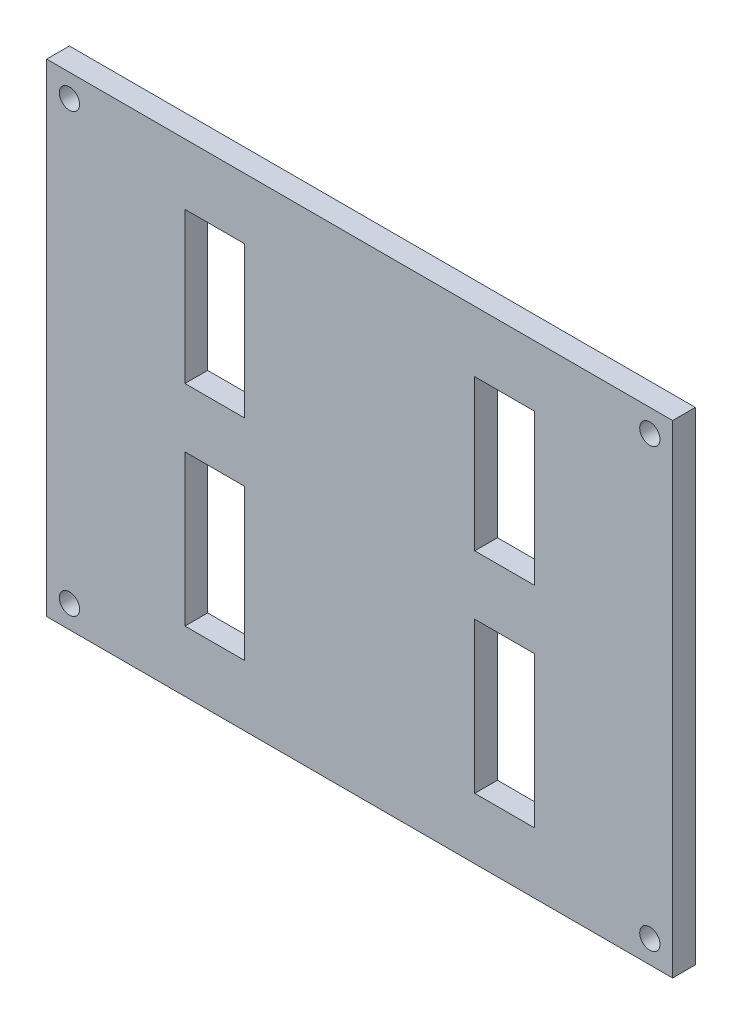
ISO-10303-21;
HEADER;
FILE_DESCRIPTION(('STEP AP214'),'2;1');
FILE_NAME('part.step','',(''),(''),'','','');
FILE_SCHEMA(('AUTOMOTIVE_DESIGN { 1 0 10303 214 1 1 1 1 }'));
ENDSEC;
DATA;
#1=APPLICATION_CONTEXT('core data for automotive mechanical design processes');
#2=APPLICATION_PROTOCOL_DEFINITION('international standard','automotive_design',2000,#1);
#3=PRODUCT_CONTEXT('',#1,'mechanical');
#4=PRODUCT('Part','Part','',(#3));
#5=PRODUCT_RELATED_PRODUCT_CATEGORY('part','',(#4));
#6=PRODUCT_DEFINITION_FORMATION('','',#4);
#7=PRODUCT_DEFINITION_CONTEXT('part definition',#1,'design');
#8=PRODUCT_DEFINITION('design','',#6,#7);
#9=PRODUCT_DEFINITION_SHAPE('','',#8);
#10=(LENGTH_UNIT() NAMED_UNIT(*) SI_UNIT(.MILLI.,.METRE.));
#11=(NAMED_UNIT(*) PLANE_ANGLE_UNIT() SI_UNIT($,.RADIAN.));
#12=(NAMED_UNIT(*) SI_UNIT($,.STERADIAN.) SOLID_ANGLE_UNIT());
#13=UNCERTAINTY_MEASURE_WITH_UNIT(LENGTH_MEASURE(1.E-05),#10,'distance_accuracy_value','');
#14=(GEOMETRIC_REPRESENTATION_CONTEXT(3) GLOBAL_UNCERTAINTY_ASSIGNED_CONTEXT((#13)) GLOBAL_UNIT_ASSIGNED_CONTEXT((#10,
#11,#12)) REPRESENTATION_CONTEXT('',''));
#15=CARTESIAN_POINT('',(0.,0.,0.));
#16=DIRECTION('',(0.,0.,1.));
#17=DIRECTION('',(1.,0.,0.));
#18=AXIS2_PLACEMENT_3D('',#15,#16,#17);
#19=CARTESIAN_POINT('',(0.,0.,0.));
#20=DIRECTION('',(0.,0.,1.));
#21=DIRECTION('',(1.,0.,0.));
#22=AXIS2_PLACEMENT_3D('',#19,#20,#21);
#23=PLANE('',#22);
#24=DIRECTION('',(1.,0.,0.));
#25=VECTOR('',#24,1.);
#26=CARTESIAN_POINT('',(0.,25.215,0.));
#27=LINE('',#26,#25);
#28=CARTESIAN_POINT('',(16.085,25.215,0.));
#29=VERTEX_POINT('',#28);
#30=CARTESIAN_POINT('',(24.415,25.215,0.));
#31=VERTEX_POINT('',#30);
#32=EDGE_CURVE('E289',#29,#31,#27,.T.);
#33=ORIENTED_EDGE('',*,*,#32,.F.);
#34=DIRECTION('',(0.,-1.,0.));
#35=VECTOR('',#34,1.);
#36=CARTESIAN_POINT('',(16.085,0.,0.));
#37=LINE('',#36,#35);
#38=CARTESIAN_POINT('',(16.085,4.13499999999998,0.));
#39=VERTEX_POINT('',#38);
#40=EDGE_CURVE('E281',#29,#39,#37,.T.);
#41=ORIENTED_EDGE('',*,*,#40,.T.);
#42=DIRECTION('',(1.,0.,0.));
#43=VECTOR('',#42,1.);
#44=CARTESIAN_POINT('',(0.,4.13499999999998,0.));
#45=LINE('',#44,#43);
#46=CARTESIAN_POINT('',(24.415,4.13499999999998,0.));
#47=VERTEX_POINT('',#46);
#48=EDGE_CURVE('E284',#39,#47,#45,.T.);
#49=ORIENTED_EDGE('',*,*,#48,.T.);
#50=DIRECTION('',(0.,-1.,0.));
#51=VECTOR('',#50,1.);
#52=CARTESIAN_POINT('',(24.415,0.,0.));
#53=LINE('',#52,#51);
#54=EDGE_CURVE('E287',#31,#47,#53,.T.);
#55=ORIENTED_EDGE('',*,*,#54,.F.);
#56=EDGE_LOOP('',(#33,#41,#49,#55));
#57=FACE_BOUND('',#56,.T.);
#58=DIRECTION('',(0.,-1.,0.));
#59=VECTOR('',#58,1.);
#60=CARTESIAN_POINT('',(-16.085,0.,0.));
#61=LINE('',#60,#59);
#62=CARTESIAN_POINT('',(-16.085,25.215,0.));
#63=VERTEX_POINT('',#62);
#64=CARTESIAN_POINT('',(-16.085,4.13499999999998,0.));
#65=VERTEX_POINT('',#64);
#66=EDGE_CURVE('E272',#63,#65,#61,.T.);
#67=ORIENTED_EDGE('',*,*,#66,.F.);
#68=DIRECTION('',(-1.,0.,0.));
#69=VECTOR('',#68,1.);
#70=CARTESIAN_POINT('',(0.,25.215,0.));
#71=LINE('',#70,#69);
#72=CARTESIAN_POINT('',(-24.415,25.215,0.));
#73=VERTEX_POINT('',#72);
#74=EDGE_CURVE('E264',#63,#73,#71,.T.);
#75=ORIENTED_EDGE('',*,*,#74,.T.);
#76=DIRECTION('',(0.,-1.,0.));
#77=VECTOR('',#76,1.);
#78=CARTESIAN_POINT('',(-24.415,0.,0.));
#79=LINE('',#78,#77);
#80=CARTESIAN_POINT('',(-24.415,4.13499999999998,0.));
#81=VERTEX_POINT('',#80);
#82=EDGE_CURVE('E267',#73,#81,#79,.T.);
#83=ORIENTED_EDGE('',*,*,#82,.T.);
#84=DIRECTION('',(-1.,0.,0.));
#85=VECTOR('',#84,1.);
#86=CARTESIAN_POINT('',(0.,4.13499999999998,0.));
#87=LINE('',#86,#85);
#88=EDGE_CURVE('E270',#65,#81,#87,.T.);
#89=ORIENTED_EDGE('',*,*,#88,.F.);
#90=EDGE_LOOP('',(#67,#75,#83,#89));
#91=FACE_BOUND('',#90,.T.);
#92=CARTESIAN_POINT('',(-40.5530194846605,-30.5530194846606,0.));
#93=DIRECTION('',(0.,0.,1.));
#94=DIRECTION('',(1.,0.,0.));
#95=AXIS2_PLACEMENT_3D('',#92,#93,#94);
#96=CIRCLE('',#95,1.415);
#97=CARTESIAN_POINT('',(-39.1380194846605,-30.5530194846606,0.));
#98=VERTEX_POINT('',#97);
#99=EDGE_CURVE('E322',#98,#98,#96,.T.);
#100=ORIENTED_EDGE('',*,*,#99,.T.);
#101=EDGE_LOOP('',(#100));
#102=FACE_BOUND('',#101,.T.);
#103=CARTESIAN_POINT('',(40.5530194846605,-30.5530194846606,0.));
#104=DIRECTION('',(0.,0.,1.));
#105=DIRECTION('',(1.,0.,0.));
#106=AXIS2_PLACEMENT_3D('',#103,#104,#105);
#107=CIRCLE('',#106,1.415);
#108=CARTESIAN_POINT('',(41.9680194846605,-30.5530194846606,0.));
#109=VERTEX_POINT('',#108);
#110=EDGE_CURVE('E319',#109,#109,#107,.T.);
#111=ORIENTED_EDGE('',*,*,#110,.T.);
#112=EDGE_LOOP('',(#111));
#113=FACE_BOUND('',#112,.T.);
#114=CARTESIAN_POINT('',(40.5530194846605,30.5530194846606,0.));
#115=DIRECTION('',(0.,0.,1.));
#116=DIRECTION('',(1.,0.,0.));
#117=AXIS2_PLACEMENT_3D('',#114,#115,#116);
#118=CIRCLE('',#117,1.415);
#119=CARTESIAN_POINT('',(41.9680194846605,30.5530194846606,0.));
#120=VERTEX_POINT('',#119);
#121=EDGE_CURVE('E316',#120,#120,#118,.T.);
#122=ORIENTED_EDGE('',*,*,#121,.T.);
#123=EDGE_LOOP('',(#122));
#124=FACE_BOUND('',#123,.T.);
#125=CARTESIAN_POINT('',(-40.5530194846605,30.5530194846606,0.));
#126=DIRECTION('',(0.,0.,1.));
#127=DIRECTION('',(1.,0.,0.));
#128=AXIS2_PLACEMENT_3D('',#125,#126,#127);
#129=CIRCLE('',#128,1.415);
#130=CARTESIAN_POINT('',(-39.1380194846605,30.5530194846606,0.));
#131=VERTEX_POINT('',#130);
#132=EDGE_CURVE('E313',#131,#131,#129,.T.);
#133=ORIENTED_EDGE('',*,*,#132,.T.);
#134=EDGE_LOOP('',(#133));
#135=FACE_BOUND('',#134,.T.);
#136=DIRECTION('',(0.,1.,0.));
#137=VECTOR('',#136,1.);
#138=CARTESIAN_POINT('',(43.735,0.,0.));
#139=LINE('',#138,#137);
#140=CARTESIAN_POINT('',(43.735,-33.735,0.));
#141=VERTEX_POINT('',#140);
#142=CARTESIAN_POINT('',(43.735,33.735,0.));
#143=VERTEX_POINT('',#142);
#144=EDGE_CURVE('E11',#141,#143,#139,.T.);
#145=ORIENTED_EDGE('',*,*,#144,.F.);
#146=DIRECTION('',(1.,0.,0.));
#147=VECTOR('',#146,1.);
#148=CARTESIAN_POINT('',(0.,-33.735,0.));
#149=LINE('',#148,#147);
#150=CARTESIAN_POINT('',(-43.735,-33.735,0.));
#151=VERTEX_POINT('',#150);
#152=EDGE_CURVE('E44',#151,#141,#149,.T.);
#153=ORIENTED_EDGE('',*,*,#152,.F.);
#154=DIRECTION('',(0.,-1.,0.));
#155=VECTOR('',#154,1.);
#156=CARTESIAN_POINT('',(-43.735,0.,0.));
#157=LINE('',#156,#155);
#158=CARTESIAN_POINT('',(-43.735,33.735,0.));
#159=VERTEX_POINT('',#158);
#160=EDGE_CURVE('E348',#159,#151,#157,.T.);
#161=ORIENTED_EDGE('',*,*,#160,.F.);
#162=DIRECTION('',(-1.,0.,0.));
#163=VECTOR('',#162,1.);
#164=CARTESIAN_POINT('',(0.,33.735,0.));
#165=LINE('',#164,#163);
#166=EDGE_CURVE('E340',#143,#159,#165,.T.);
#167=ORIENTED_EDGE('',*,*,#166,.F.);
#168=EDGE_LOOP('',(#145,#153,#161,#167));
#169=FACE_BOUND('',#168,.T.);
#170=DIRECTION('',(0.,1.,0.));
#171=VECTOR('',#170,1.);
#172=CARTESIAN_POINT('',(16.085,0.,0.));
#173=LINE('',#172,#171);
#174=CARTESIAN_POINT('',(16.085,-25.215,0.));
#175=VERTEX_POINT('',#174);
#176=CARTESIAN_POINT('',(16.085,-4.13499999999999,0.));
#177=VERTEX_POINT('',#176);
#178=EDGE_CURVE('E279',#175,#177,#173,.T.);
#179=ORIENTED_EDGE('',*,*,#178,.F.);
#180=DIRECTION('',(1.,0.,0.));
#181=VECTOR('',#180,1.);
#182=CARTESIAN_POINT('',(0.,-25.215,0.));
#183=LINE('',#182,#181);
#184=CARTESIAN_POINT('',(24.415,-25.215,0.));
#185=VERTEX_POINT('',#184);
#186=EDGE_CURVE('E274',#175,#185,#183,.T.);
#187=ORIENTED_EDGE('',*,*,#186,.T.);
#188=DIRECTION('',(0.,1.,0.));
#189=VECTOR('',#188,1.);
#190=CARTESIAN_POINT('',(24.415,0.,0.));
#191=LINE('',#190,#189);
#192=CARTESIAN_POINT('',(24.415,-4.13499999999999,0.));
#193=VERTEX_POINT('',#192);
#194=EDGE_CURVE('E181',#185,#193,#191,.T.);
#195=ORIENTED_EDGE('',*,*,#194,.T.);
#196=DIRECTION('',(1.,0.,0.));
#197=VECTOR('',#196,1.);
#198=CARTESIAN_POINT('',(0.,-4.13499999999999,0.));
#199=LINE('',#198,#197);
#200=EDGE_CURVE('E277',#177,#193,#199,.T.);
#201=ORIENTED_EDGE('',*,*,#200,.F.);
#202=EDGE_LOOP('',(#179,#187,#195,#201));
#203=FACE_BOUND('',#202,.T.);
#204=DIRECTION('',(-1.,0.,0.));
#205=VECTOR('',#204,1.);
#206=CARTESIAN_POINT('',(0.,-25.215,0.));
#207=LINE('',#206,#205);
#208=CARTESIAN_POINT('',(-16.085,-25.215,0.));
#209=VERTEX_POINT('',#208);
#210=CARTESIAN_POINT('',(-24.415,-25.215,0.));
#211=VERTEX_POINT('',#210);
#212=EDGE_CURVE('E299',#209,#211,#207,.T.);
#213=ORIENTED_EDGE('',*,*,#212,.F.);
#214=DIRECTION('',(0.,1.,0.));
#215=VECTOR('',#214,1.);
#216=CARTESIAN_POINT('',(-16.085,0.,0.));
#217=LINE('',#216,#215);
#218=CARTESIAN_POINT('',(-16.085,-4.13499999999999,0.));
#219=VERTEX_POINT('',#218);
#220=EDGE_CURVE('E291',#209,#219,#217,.T.);
#221=ORIENTED_EDGE('',*,*,#220,.T.);
#222=DIRECTION('',(-1.,0.,0.));
#223=VECTOR('',#222,1.);
#224=CARTESIAN_POINT('',(0.,-4.13499999999999,0.));
#225=LINE('',#224,#223);
#226=CARTESIAN_POINT('',(-24.415,-4.13499999999999,0.));
#227=VERTEX_POINT('',#226);
#228=EDGE_CURVE('E294',#219,#227,#225,.T.);
#229=ORIENTED_EDGE('',*,*,#228,.T.);
#230=DIRECTION('',(0.,1.,0.));
#231=VECTOR('',#230,1.);
#232=CARTESIAN_POINT('',(-24.415,0.,0.));
#233=LINE('',#232,#231);
#234=EDGE_CURVE('E297',#211,#227,#233,.T.);
#235=ORIENTED_EDGE('',*,*,#234,.F.);
#236=EDGE_LOOP('',(#213,#221,#229,#235));
#237=FACE_BOUND('',#236,.T.);
#238=ADVANCED_FACE('F37',(#57,#91,#102,#113,#124,#135,#169,#203,#237),#23,.F.);
#239=CARTESIAN_POINT('',(0.,0.,3.175));
#240=DIRECTION('',(0.,0.,1.));
#241=DIRECTION('',(1.,0.,0.));
#242=AXIS2_PLACEMENT_3D('',#239,#240,#241);
#243=PLANE('',#242);
#244=CARTESIAN_POINT('',(-40.5530194846605,-30.5530194846606,3.175));
#245=DIRECTION('',(0.,0.,1.));
#246=DIRECTION('',(-1.,0.,0.));
#247=AXIS2_PLACEMENT_3D('',#244,#245,#246);
#248=CIRCLE('',#247,1.415);
#249=CARTESIAN_POINT('',(-41.9680194846605,-30.5530194846606,3.175));
#250=VERTEX_POINT('',#249);
#251=EDGE_CURVE('E301',#250,#250,#248,.T.);
#252=ORIENTED_EDGE('',*,*,#251,.F.);
#253=EDGE_LOOP('',(#252));
#254=FACE_BOUND('',#253,.T.);
#255=CARTESIAN_POINT('',(40.5530194846605,-30.5530194846606,3.175));
#256=DIRECTION('',(0.,0.,1.));
#257=DIRECTION('',(1.,0.,0.));
#258=AXIS2_PLACEMENT_3D('',#255,#256,#257);
#259=CIRCLE('',#258,1.415);
#260=CARTESIAN_POINT('',(41.9680194846605,-30.5530194846606,3.175));
#261=VERTEX_POINT('',#260);
#262=EDGE_CURVE('E306',#261,#261,#259,.T.);
#263=ORIENTED_EDGE('',*,*,#262,.F.);
#264=EDGE_LOOP('',(#263));
#265=FACE_BOUND('',#264,.T.);
#266=CARTESIAN_POINT('',(40.5530194846605,30.5530194846606,3.175));
#267=DIRECTION('',(0.,0.,1.));
#268=DIRECTION('',(-1.,0.,0.));
#269=AXIS2_PLACEMENT_3D('',#266,#267,#268);
#270=CIRCLE('',#269,1.415);
#271=CARTESIAN_POINT('',(39.1380194846605,30.5530194846606,3.175));
#272=VERTEX_POINT('',#271);
#273=EDGE_CURVE('E302',#272,#272,#270,.T.);
#274=ORIENTED_EDGE('',*,*,#273,.F.);
#275=EDGE_LOOP('',(#274));
#276=FACE_BOUND('',#275,.T.);
#277=CARTESIAN_POINT('',(-40.5530194846605,30.5530194846606,3.175));
#278=DIRECTION('',(0.,0.,1.));
#279=DIRECTION('',(1.,0.,0.));
#280=AXIS2_PLACEMENT_3D('',#277,#278,#279);
#281=CIRCLE('',#280,1.415);
#282=CARTESIAN_POINT('',(-39.1380194846605,30.5530194846606,3.175));
#283=VERTEX_POINT('',#282);
#284=EDGE_CURVE('E305',#283,#283,#281,.T.);
#285=ORIENTED_EDGE('',*,*,#284,.F.);
#286=EDGE_LOOP('',(#285));
#287=FACE_BOUND('',#286,.T.);
#288=DIRECTION('',(1.,0.,0.));
#289=VECTOR('',#288,1.);
#290=CARTESIAN_POINT('',(-43.735,-33.735,3.175));
#291=LINE('',#290,#289);
#292=CARTESIAN_POINT('',(-43.735,-33.735,3.175));
#293=VERTEX_POINT('',#292);
#294=CARTESIAN_POINT('',(43.735,-33.735,3.175));
#295=VERTEX_POINT('',#294);
#296=EDGE_CURVE('E334',#293,#295,#291,.T.);
#297=ORIENTED_EDGE('',*,*,#296,.T.);
#298=DIRECTION('',(0.,1.,0.));
#299=VECTOR('',#298,1.);
#300=CARTESIAN_POINT('',(43.735,33.735,3.175));
#301=LINE('',#300,#299);
#302=CARTESIAN_POINT('',(43.735,33.735,3.175));
#303=VERTEX_POINT('',#302);
#304=EDGE_CURVE('E325',#295,#303,#301,.T.);
#305=ORIENTED_EDGE('',*,*,#304,.T.);
#306=DIRECTION('',(-1.,0.,0.));
#307=VECTOR('',#306,1.);
#308=CARTESIAN_POINT('',(-43.735,33.735,3.175));
#309=LINE('',#308,#307);
#310=CARTESIAN_POINT('',(-43.735,33.735,3.175));
#311=VERTEX_POINT('',#310);
#312=EDGE_CURVE('E328',#303,#311,#309,.T.);
#313=ORIENTED_EDGE('',*,*,#312,.T.);
#314=DIRECTION('',(0.,-1.,0.));
#315=VECTOR('',#314,1.);
#316=CARTESIAN_POINT('',(-43.735,33.735,3.175));
#317=LINE('',#316,#315);
#318=EDGE_CURVE('E331',#311,#293,#317,.T.);
#319=ORIENTED_EDGE('',*,*,#318,.T.);
#320=EDGE_LOOP('',(#297,#305,#313,#319));
#321=FACE_BOUND('',#320,.T.);
#322=DIRECTION('',(-1.,0.,0.));
#323=VECTOR('',#322,1.);
#324=CARTESIAN_POINT('',(-16.085,25.215,3.175));
#325=LINE('',#324,#323);
#326=CARTESIAN_POINT('',(-16.085,25.215,3.175));
#327=VERTEX_POINT('',#326);
#328=CARTESIAN_POINT('',(-24.415,25.215,3.175));
#329=VERTEX_POINT('',#328);
#330=EDGE_CURVE('E252',#327,#329,#325,.T.);
#331=ORIENTED_EDGE('',*,*,#330,.F.);
#332=DIRECTION('',(0.,-1.,0.));
#333=VECTOR('',#332,1.);
#334=CARTESIAN_POINT('',(-16.085,25.215,3.175));
#335=LINE('',#334,#333);
#336=CARTESIAN_POINT('',(-16.085,4.13499999999998,3.175));
#337=VERTEX_POINT('',#336);
#338=EDGE_CURVE('E226',#327,#337,#335,.T.);
#339=ORIENTED_EDGE('',*,*,#338,.T.);
#340=DIRECTION('',(-1.,0.,0.));
#341=VECTOR('',#340,1.);
#342=CARTESIAN_POINT('',(-16.085,4.13499999999998,3.175));
#343=LINE('',#342,#341);
#344=CARTESIAN_POINT('',(-24.415,4.13499999999998,3.175));
#345=VERTEX_POINT('',#344);
#346=EDGE_CURVE('E246',#337,#345,#343,.T.);
#347=ORIENTED_EDGE('',*,*,#346,.T.);
#348=DIRECTION('',(0.,-1.,0.));
#349=VECTOR('',#348,1.);
#350=CARTESIAN_POINT('',(-24.415,25.215,3.175));
#351=LINE('',#350,#349);
#352=EDGE_CURVE('E249',#329,#345,#351,.T.);
#353=ORIENTED_EDGE('',*,*,#352,.F.);
#354=EDGE_LOOP('',(#331,#339,#347,#353));
#355=FACE_BOUND('',#354,.T.);
#356=DIRECTION('',(1.,0.,0.));
#357=VECTOR('',#356,1.);
#358=CARTESIAN_POINT('',(16.085,-25.215,3.175));
#359=LINE('',#358,#357);
#360=CARTESIAN_POINT('',(16.085,-25.215,3.175));
#361=VERTEX_POINT('',#360);
#362=CARTESIAN_POINT('',(24.415,-25.215,3.175));
#363=VERTEX_POINT('',#362);
#364=EDGE_CURVE('E189',#361,#363,#359,.T.);
#365=ORIENTED_EDGE('',*,*,#364,.F.);
#366=DIRECTION('',(0.,1.,0.));
#367=VECTOR('',#366,1.);
#368=CARTESIAN_POINT('',(16.085,-25.215,3.175));
#369=LINE('',#368,#367);
#370=CARTESIAN_POINT('',(16.085,-4.13499999999999,3.175));
#371=VERTEX_POINT('',#370);
#372=EDGE_CURVE('E200',#361,#371,#369,.T.);
#373=ORIENTED_EDGE('',*,*,#372,.T.);
#374=DIRECTION('',(1.,0.,0.));
#375=VECTOR('',#374,1.);
#376=CARTESIAN_POINT('',(16.085,-4.13499999999999,3.175));
#377=LINE('',#376,#375);
#378=CARTESIAN_POINT('',(24.415,-4.13499999999999,3.175));
#379=VERTEX_POINT('',#378);
#380=EDGE_CURVE('E198',#371,#379,#377,.T.);
#381=ORIENTED_EDGE('',*,*,#380,.T.);
#382=DIRECTION('',(0.,1.,0.));
#383=VECTOR('',#382,1.);
#384=CARTESIAN_POINT('',(24.415,-25.215,3.175));
#385=LINE('',#384,#383);
#386=EDGE_CURVE('E178',#363,#379,#385,.T.);
#387=ORIENTED_EDGE('',*,*,#386,.F.);
#388=EDGE_LOOP('',(#365,#373,#381,#387));
#389=FACE_BOUND('',#388,.T.);
#390=DIRECTION('',(0.,-1.,0.));
#391=VECTOR('',#390,1.);
#392=CARTESIAN_POINT('',(16.085,25.215,3.175));
#393=LINE('',#392,#391);
#394=CARTESIAN_POINT('',(16.085,25.215,3.175));
#395=VERTEX_POINT('',#394);
#396=CARTESIAN_POINT('',(16.085,4.13499999999998,3.175));
#397=VERTEX_POINT('',#396);
#398=EDGE_CURVE('E234',#395,#397,#393,.T.);
#399=ORIENTED_EDGE('',*,*,#398,.F.);
#400=DIRECTION('',(1.,0.,0.));
#401=VECTOR('',#400,1.);
#402=CARTESIAN_POINT('',(16.085,25.215,3.175));
#403=LINE('',#402,#401);
#404=CARTESIAN_POINT('',(24.415,25.215,3.175));
#405=VERTEX_POINT('',#404);
#406=EDGE_CURVE('E209',#395,#405,#403,.T.);
#407=ORIENTED_EDGE('',*,*,#406,.T.);
#408=DIRECTION('',(0.,-1.,0.));
#409=VECTOR('',#408,1.);
#410=CARTESIAN_POINT('',(24.415,25.215,3.175));
#411=LINE('',#410,#409);
#412=CARTESIAN_POINT('',(24.415,4.13499999999998,3.175));
#413=VERTEX_POINT('',#412);
#414=EDGE_CURVE('E239',#405,#413,#411,.T.);
#415=ORIENTED_EDGE('',*,*,#414,.T.);
#416=DIRECTION('',(1.,0.,0.));
#417=VECTOR('',#416,1.);
#418=CARTESIAN_POINT('',(16.085,4.13499999999998,3.175));
#419=LINE('',#418,#417);
#420=EDGE_CURVE('E236',#397,#413,#419,.T.);
#421=ORIENTED_EDGE('',*,*,#420,.F.);
#422=EDGE_LOOP('',(#399,#407,#415,#421));
#423=FACE_BOUND('',#422,.T.);
#424=DIRECTION('',(0.,1.,0.));
#425=VECTOR('',#424,1.);
#426=CARTESIAN_POINT('',(-16.085,-25.215,3.175));
#427=LINE('',#426,#425);
#428=CARTESIAN_POINT('',(-16.085,-25.215,3.175));
#429=VERTEX_POINT('',#428);
#430=CARTESIAN_POINT('',(-16.085,-4.13499999999999,3.175));
#431=VERTEX_POINT('',#430);
#432=EDGE_CURVE('E215',#429,#431,#427,.T.);
#433=ORIENTED_EDGE('',*,*,#432,.F.);
#434=DIRECTION('',(-1.,0.,0.));
#435=VECTOR('',#434,1.);
#436=CARTESIAN_POINT('',(-16.085,-25.215,3.175));
#437=LINE('',#436,#435);
#438=CARTESIAN_POINT('',(-24.415,-25.215,3.175));
#439=VERTEX_POINT('',#438);
#440=EDGE_CURVE('E223',#429,#439,#437,.T.);
#441=ORIENTED_EDGE('',*,*,#440,.T.);
#442=DIRECTION('',(0.,1.,0.));
#443=VECTOR('',#442,1.);
#444=CARTESIAN_POINT('',(-24.415,-25.215,3.175));
#445=LINE('',#444,#443);
#446=CARTESIAN_POINT('',(-24.415,-4.13499999999999,3.175));
#447=VERTEX_POINT('',#446);
#448=EDGE_CURVE('E220',#439,#447,#445,.T.);
#449=ORIENTED_EDGE('',*,*,#448,.T.);
#450=DIRECTION('',(-1.,0.,0.));
#451=VECTOR('',#450,1.);
#452=CARTESIAN_POINT('',(-16.085,-4.13499999999999,3.175));
#453=LINE('',#452,#451);
#454=EDGE_CURVE('E217',#431,#447,#453,.T.);
#455=ORIENTED_EDGE('',*,*,#454,.F.);
#456=EDGE_LOOP('',(#433,#441,#449,#455));
#457=FACE_BOUND('',#456,.T.);
#458=ADVANCED_FACE('F195',(#254,#265,#276,#287,#321,#355,#389,#423,#457),#243,.T.);
#459=CARTESIAN_POINT('',(43.735,33.735,-6.825));
#460=DIRECTION('',(1.,0.,0.));
#461=DIRECTION('',(0.,1.,0.));
#462=AXIS2_PLACEMENT_3D('',#459,#460,#461);
#463=PLANE('',#462);
#464=ORIENTED_EDGE('',*,*,#144,.T.);
#465=DIRECTION('',(0.,0.,1.));
#466=VECTOR('',#465,1.);
#467=CARTESIAN_POINT('',(43.735,33.735,-6.825));
#468=LINE('',#467,#466);
#469=EDGE_CURVE('E337',#143,#303,#468,.T.);
#470=ORIENTED_EDGE('',*,*,#469,.T.);
#471=ORIENTED_EDGE('',*,*,#304,.F.);
#472=DIRECTION('',(0.,0.,1.));
#473=VECTOR('',#472,1.);
#474=CARTESIAN_POINT('',(43.735,-33.735,-6.825));
#475=LINE('',#474,#473);
#476=EDGE_CURVE('E338',#141,#295,#475,.T.);
#477=ORIENTED_EDGE('',*,*,#476,.F.);
#478=EDGE_LOOP('',(#464,#470,#471,#477));
#479=FACE_BOUND('',#478,.T.);
#480=ADVANCED_FACE('F360',(#479),#463,.T.);
#481=CARTESIAN_POINT('',(-43.735,-33.735,-6.825));
#482=DIRECTION('',(0.,-1.,0.));
#483=DIRECTION('',(0.,0.,-1.));
#484=AXIS2_PLACEMENT_3D('',#481,#482,#483);
#485=PLANE('',#484);
#486=ORIENTED_EDGE('',*,*,#152,.T.);
#487=ORIENTED_EDGE('',*,*,#476,.T.);
#488=ORIENTED_EDGE('',*,*,#296,.F.);
#489=DIRECTION('',(0.,0.,1.));
#490=VECTOR('',#489,1.);
#491=CARTESIAN_POINT('',(-43.735,-33.735,-6.825));
#492=LINE('',#491,#490);
#493=EDGE_CURVE('E341',#151,#293,#492,.T.);
#494=ORIENTED_EDGE('',*,*,#493,.F.);
#495=EDGE_LOOP('',(#486,#487,#488,#494));
#496=FACE_BOUND('',#495,.T.);
#497=ADVANCED_FACE('F353',(#496),#485,.T.);
#498=CARTESIAN_POINT('',(-43.735,33.735,-6.825));
#499=DIRECTION('',(-1.,0.,0.));
#500=DIRECTION('',(0.,-1.,0.));
#501=AXIS2_PLACEMENT_3D('',#498,#499,#500);
#502=PLANE('',#501);
#503=ORIENTED_EDGE('',*,*,#160,.T.);
#504=ORIENTED_EDGE('',*,*,#493,.T.);
#505=ORIENTED_EDGE('',*,*,#318,.F.);
#506=DIRECTION('',(0.,0.,1.));
#507=VECTOR('',#506,1.);
#508=CARTESIAN_POINT('',(-43.735,33.735,-6.825));
#509=LINE('',#508,#507);
#510=EDGE_CURVE('E343',#159,#311,#509,.T.);
#511=ORIENTED_EDGE('',*,*,#510,.F.);
#512=EDGE_LOOP('',(#503,#504,#505,#511));
#513=FACE_BOUND('',#512,.T.);
#514=ADVANCED_FACE('F368',(#513),#502,.T.);
#515=CARTESIAN_POINT('',(-43.735,33.735,-6.825));
#516=DIRECTION('',(0.,1.,0.));
#517=DIRECTION('',(0.,0.,1.));
#518=AXIS2_PLACEMENT_3D('',#515,#516,#517);
#519=PLANE('',#518);
#520=ORIENTED_EDGE('',*,*,#166,.T.);
#521=ORIENTED_EDGE('',*,*,#510,.T.);
#522=ORIENTED_EDGE('',*,*,#312,.F.);
#523=ORIENTED_EDGE('',*,*,#469,.F.);
#524=EDGE_LOOP('',(#520,#521,#522,#523));
#525=FACE_BOUND('',#524,.T.);
#526=ADVANCED_FACE('F365',(#525),#519,.T.);
#527=CARTESIAN_POINT('',(-40.5530194846605,30.5530194846606,-6.825));
#528=DIRECTION('',(0.,0.,1.));
#529=DIRECTION('',(1.,0.,0.));
#530=AXIS2_PLACEMENT_3D('',#527,#528,#529);
#531=CYLINDRICAL_SURFACE('',#530,1.415);
#532=ORIENTED_EDGE('',*,*,#284,.T.);
#533=EDGE_LOOP('',(#532));
#534=FACE_BOUND('',#533,.T.);
#535=ORIENTED_EDGE('',*,*,#132,.F.);
#536=EDGE_LOOP('',(#535));
#537=FACE_BOUND('',#536,.T.);
#538=ADVANCED_FACE('F598',(#534,#537),#531,.F.);
#539=CARTESIAN_POINT('',(40.5530194846605,30.5530194846606,-6.825));
#540=DIRECTION('',(0.,0.,1.));
#541=DIRECTION('',(1.,0.,0.));
#542=AXIS2_PLACEMENT_3D('',#539,#540,#541);
#543=CYLINDRICAL_SURFACE('',#542,1.415);
#544=ORIENTED_EDGE('',*,*,#273,.T.);
#545=EDGE_LOOP('',(#544));
#546=FACE_BOUND('',#545,.T.);
#547=ORIENTED_EDGE('',*,*,#121,.F.);
#548=EDGE_LOOP('',(#547));
#549=FACE_BOUND('',#548,.T.);
#550=ADVANCED_FACE('F589',(#546,#549),#543,.F.);
#551=CARTESIAN_POINT('',(40.5530194846605,-30.5530194846606,-6.825));
#552=DIRECTION('',(0.,0.,1.));
#553=DIRECTION('',(1.,0.,0.));
#554=AXIS2_PLACEMENT_3D('',#551,#552,#553);
#555=CYLINDRICAL_SURFACE('',#554,1.415);
#556=ORIENTED_EDGE('',*,*,#262,.T.);
#557=EDGE_LOOP('',(#556));
#558=FACE_BOUND('',#557,.T.);
#559=ORIENTED_EDGE('',*,*,#110,.F.);
#560=EDGE_LOOP('',(#559));
#561=FACE_BOUND('',#560,.T.);
#562=ADVANCED_FACE('F580',(#558,#561),#555,.F.);
#563=CARTESIAN_POINT('',(-40.5530194846605,-30.5530194846606,-6.825));
#564=DIRECTION('',(0.,0.,1.));
#565=DIRECTION('',(1.,0.,0.));
#566=AXIS2_PLACEMENT_3D('',#563,#564,#565);
#567=CYLINDRICAL_SURFACE('',#566,1.415);
#568=ORIENTED_EDGE('',*,*,#251,.T.);
#569=EDGE_LOOP('',(#568));
#570=FACE_BOUND('',#569,.T.);
#571=ORIENTED_EDGE('',*,*,#99,.F.);
#572=EDGE_LOOP('',(#571));
#573=FACE_BOUND('',#572,.T.);
#574=ADVANCED_FACE('F563',(#570,#573),#567,.F.);
#575=CARTESIAN_POINT('',(-16.085,25.215,-6.825));
#576=DIRECTION('',(-1.,0.,0.));
#577=DIRECTION('',(0.,0.,1.));
#578=AXIS2_PLACEMENT_3D('',#575,#576,#577);
#579=PLANE('',#578);
#580=ORIENTED_EDGE('',*,*,#66,.T.);
#581=DIRECTION('',(0.,0.,1.));
#582=VECTOR('',#581,1.);
#583=CARTESIAN_POINT('',(-16.085,4.13499999999998,-6.825));
#584=LINE('',#583,#582);
#585=EDGE_CURVE('E262',#65,#337,#584,.T.);
#586=ORIENTED_EDGE('',*,*,#585,.T.);
#587=ORIENTED_EDGE('',*,*,#338,.F.);
#588=DIRECTION('',(0.,0.,1.));
#589=VECTOR('',#588,1.);
#590=CARTESIAN_POINT('',(-16.085,25.215,-6.825));
#591=LINE('',#590,#589);
#592=EDGE_CURVE('E255',#63,#327,#591,.T.);
#593=ORIENTED_EDGE('',*,*,#592,.F.);
#594=EDGE_LOOP('',(#580,#586,#587,#593));
#595=FACE_BOUND('',#594,.T.);
#596=ADVANCED_FACE('F381',(#595),#579,.T.);
#597=CARTESIAN_POINT('',(-16.085,4.13499999999998,-6.825));
#598=DIRECTION('',(0.,1.,0.));
#599=DIRECTION('',(-1.,0.,0.));
#600=AXIS2_PLACEMENT_3D('',#597,#598,#599);
#601=PLANE('',#600);
#602=ORIENTED_EDGE('',*,*,#88,.T.);
#603=DIRECTION('',(0.,0.,1.));
#604=VECTOR('',#603,1.);
#605=CARTESIAN_POINT('',(-24.415,4.13499999999998,-6.825));
#606=LINE('',#605,#604);
#607=EDGE_CURVE('E260',#81,#345,#606,.T.);
#608=ORIENTED_EDGE('',*,*,#607,.T.);
#609=ORIENTED_EDGE('',*,*,#346,.F.);
#610=ORIENTED_EDGE('',*,*,#585,.F.);
#611=EDGE_LOOP('',(#602,#608,#609,#610));
#612=FACE_BOUND('',#611,.T.);
#613=ADVANCED_FACE('F388',(#612),#601,.T.);
#614=CARTESIAN_POINT('',(-24.415,25.215,-6.825));
#615=DIRECTION('',(-1.,0.,0.));
#616=DIRECTION('',(0.,0.,1.));
#617=AXIS2_PLACEMENT_3D('',#614,#615,#616);
#618=PLANE('',#617);
#619=DIRECTION('',(0.,0.,1.));
#620=VECTOR('',#619,1.);
#621=CARTESIAN_POINT('',(-24.415,25.215,-6.825));
#622=LINE('',#621,#620);
#623=EDGE_CURVE('E258',#73,#329,#622,.T.);
#624=ORIENTED_EDGE('',*,*,#623,.T.);
#625=ORIENTED_EDGE('',*,*,#352,.T.);
#626=ORIENTED_EDGE('',*,*,#607,.F.);
#627=ORIENTED_EDGE('',*,*,#82,.F.);
#628=EDGE_LOOP('',(#624,#625,#626,#627));
#629=FACE_BOUND('',#628,.T.);
#630=ADVANCED_FACE('F391',(#629),#618,.F.);
#631=CARTESIAN_POINT('',(-16.085,25.215,-6.825));
#632=DIRECTION('',(0.,1.,0.));
#633=DIRECTION('',(0.,0.,1.));
#634=AXIS2_PLACEMENT_3D('',#631,#632,#633);
#635=PLANE('',#634);
#636=ORIENTED_EDGE('',*,*,#592,.T.);
#637=ORIENTED_EDGE('',*,*,#330,.T.);
#638=ORIENTED_EDGE('',*,*,#623,.F.);
#639=ORIENTED_EDGE('',*,*,#74,.F.);
#640=EDGE_LOOP('',(#636,#637,#638,#639));
#641=FACE_BOUND('',#640,.T.);
#642=ADVANCED_FACE('F376',(#641),#635,.F.);
#643=CARTESIAN_POINT('',(16.085,-25.215,-6.825));
#644=DIRECTION('',(1.,0.,0.));
#645=DIRECTION('',(0.,0.,-1.));
#646=AXIS2_PLACEMENT_3D('',#643,#644,#645);
#647=PLANE('',#646);
#648=ORIENTED_EDGE('',*,*,#178,.T.);
#649=DIRECTION('',(0.,0.,1.));
#650=VECTOR('',#649,1.);
#651=CARTESIAN_POINT('',(16.085,-4.13499999999999,-6.825));
#652=LINE('',#651,#650);
#653=EDGE_CURVE('E461',#177,#371,#652,.T.);
#654=ORIENTED_EDGE('',*,*,#653,.T.);
#655=ORIENTED_EDGE('',*,*,#372,.F.);
#656=DIRECTION('',(0.,0.,1.));
#657=VECTOR('',#656,1.);
#658=CARTESIAN_POINT('',(16.085,-25.215,-6.825));
#659=LINE('',#658,#657);
#660=EDGE_CURVE('E184',#175,#361,#659,.T.);
#661=ORIENTED_EDGE('',*,*,#660,.F.);
#662=EDGE_LOOP('',(#648,#654,#655,#661));
#663=FACE_BOUND('',#662,.T.);
#664=ADVANCED_FACE('F398',(#663),#647,.T.);
#665=CARTESIAN_POINT('',(16.085,-4.13499999999999,-6.825));
#666=DIRECTION('',(0.,-1.,0.));
#667=DIRECTION('',(0.,0.,-1.));
#668=AXIS2_PLACEMENT_3D('',#665,#666,#667);
#669=PLANE('',#668);
#670=ORIENTED_EDGE('',*,*,#200,.T.);
#671=DIRECTION('',(0.,0.,1.));
#672=VECTOR('',#671,1.);
#673=CARTESIAN_POINT('',(24.415,-4.13499999999999,-6.825));
#674=LINE('',#673,#672);
#675=EDGE_CURVE('E185',#193,#379,#674,.T.);
#676=ORIENTED_EDGE('',*,*,#675,.T.);
#677=ORIENTED_EDGE('',*,*,#380,.F.);
#678=ORIENTED_EDGE('',*,*,#653,.F.);
#679=EDGE_LOOP('',(#670,#676,#677,#678));
#680=FACE_BOUND('',#679,.T.);
#681=ADVANCED_FACE('F451',(#680),#669,.T.);
#682=CARTESIAN_POINT('',(24.415,-25.215,-6.825));
#683=DIRECTION('',(1.,0.,0.));
#684=DIRECTION('',(0.,0.,-1.));
#685=AXIS2_PLACEMENT_3D('',#682,#683,#684);
#686=PLANE('',#685);
#687=DIRECTION('',(0.,0.,1.));
#688=VECTOR('',#687,1.);
#689=CARTESIAN_POINT('',(24.415,-25.215,-6.825));
#690=LINE('',#689,#688);
#691=EDGE_CURVE('E173',#185,#363,#690,.T.);
#692=ORIENTED_EDGE('',*,*,#691,.T.);
#693=ORIENTED_EDGE('',*,*,#386,.T.);
#694=ORIENTED_EDGE('',*,*,#675,.F.);
#695=ORIENTED_EDGE('',*,*,#194,.F.);
#696=EDGE_LOOP('',(#692,#693,#694,#695));
#697=FACE_BOUND('',#696,.T.);
#698=ADVANCED_FACE('F175',(#697),#686,.F.);
#699=CARTESIAN_POINT('',(16.085,-25.215,-6.825));
#700=DIRECTION('',(0.,-1.,0.));
#701=DIRECTION('',(0.,0.,-1.));
#702=AXIS2_PLACEMENT_3D('',#699,#700,#701);
#703=PLANE('',#702);
#704=ORIENTED_EDGE('',*,*,#660,.T.);
#705=ORIENTED_EDGE('',*,*,#364,.T.);
#706=ORIENTED_EDGE('',*,*,#691,.F.);
#707=ORIENTED_EDGE('',*,*,#186,.F.);
#708=EDGE_LOOP('',(#704,#705,#706,#707));
#709=FACE_BOUND('',#708,.T.);
#710=ADVANCED_FACE('F190',(#709),#703,.F.);
#711=CARTESIAN_POINT('',(16.085,25.215,-6.825));
#712=DIRECTION('',(0.,-1.,0.));
#713=DIRECTION('',(0.,0.,-1.));
#714=AXIS2_PLACEMENT_3D('',#711,#712,#713);
#715=PLANE('',#714);
#716=ORIENTED_EDGE('',*,*,#32,.T.);
#717=DIRECTION('',(0.,0.,1.));
#718=VECTOR('',#717,1.);
#719=CARTESIAN_POINT('',(24.415,25.215,-6.825));
#720=LINE('',#719,#718);
#721=EDGE_CURVE('E205',#31,#405,#720,.T.);
#722=ORIENTED_EDGE('',*,*,#721,.T.);
#723=ORIENTED_EDGE('',*,*,#406,.F.);
#724=DIRECTION('',(0.,0.,1.));
#725=VECTOR('',#724,1.);
#726=CARTESIAN_POINT('',(16.085,25.215,-6.825));
#727=LINE('',#726,#725);
#728=EDGE_CURVE('E231',#29,#395,#727,.T.);
#729=ORIENTED_EDGE('',*,*,#728,.F.);
#730=EDGE_LOOP('',(#716,#722,#723,#729));
#731=FACE_BOUND('',#730,.T.);
#732=ADVANCED_FACE('F410',(#731),#715,.T.);
#733=CARTESIAN_POINT('',(24.415,25.215,-6.825));
#734=DIRECTION('',(-1.,0.,0.));
#735=DIRECTION('',(0.,0.,1.));
#736=AXIS2_PLACEMENT_3D('',#733,#734,#735);
#737=PLANE('',#736);
#738=ORIENTED_EDGE('',*,*,#54,.T.);
#739=DIRECTION('',(0.,0.,1.));
#740=VECTOR('',#739,1.);
#741=CARTESIAN_POINT('',(24.415,4.13499999999998,-6.825));
#742=LINE('',#741,#740);
#743=EDGE_CURVE('E228',#47,#413,#742,.T.);
#744=ORIENTED_EDGE('',*,*,#743,.T.);
#745=ORIENTED_EDGE('',*,*,#414,.F.);
#746=ORIENTED_EDGE('',*,*,#721,.F.);
#747=EDGE_LOOP('',(#738,#744,#745,#746));
#748=FACE_BOUND('',#747,.T.);
#749=ADVANCED_FACE('F413',(#748),#737,.T.);
#750=CARTESIAN_POINT('',(16.085,4.13499999999998,-6.825));
#751=DIRECTION('',(0.,-1.,0.));
#752=DIRECTION('',(1.,0.,0.));
#753=AXIS2_PLACEMENT_3D('',#750,#751,#752);
#754=PLANE('',#753);
#755=DIRECTION('',(0.,0.,1.));
#756=VECTOR('',#755,1.);
#757=CARTESIAN_POINT('',(16.085,4.13499999999998,-6.825));
#758=LINE('',#757,#756);
#759=EDGE_CURVE('E59',#39,#397,#758,.T.);
#760=ORIENTED_EDGE('',*,*,#759,.T.);
#761=ORIENTED_EDGE('',*,*,#420,.T.);
#762=ORIENTED_EDGE('',*,*,#743,.F.);
#763=ORIENTED_EDGE('',*,*,#48,.F.);
#764=EDGE_LOOP('',(#760,#761,#762,#763));
#765=FACE_BOUND('',#764,.T.);
#766=ADVANCED_FACE('F420',(#765),#754,.F.);
#767=CARTESIAN_POINT('',(16.085,25.215,-6.825));
#768=DIRECTION('',(-1.,0.,0.));
#769=DIRECTION('',(0.,0.,1.));
#770=AXIS2_PLACEMENT_3D('',#767,#768,#769);
#771=PLANE('',#770);
#772=ORIENTED_EDGE('',*,*,#728,.T.);
#773=ORIENTED_EDGE('',*,*,#398,.T.);
#774=ORIENTED_EDGE('',*,*,#759,.F.);
#775=ORIENTED_EDGE('',*,*,#40,.F.);
#776=EDGE_LOOP('',(#772,#773,#774,#775));
#777=FACE_BOUND('',#776,.T.);
#778=ADVANCED_FACE('F418',(#777),#771,.F.);
#779=CARTESIAN_POINT('',(-16.085,-25.215,-6.825));
#780=DIRECTION('',(0.,1.,0.));
#781=DIRECTION('',(0.,0.,1.));
#782=AXIS2_PLACEMENT_3D('',#779,#780,#781);
#783=PLANE('',#782);
#784=ORIENTED_EDGE('',*,*,#212,.T.);
#785=DIRECTION('',(0.,0.,1.));
#786=VECTOR('',#785,1.);
#787=CARTESIAN_POINT('',(-24.415,-25.215,-6.825));
#788=LINE('',#787,#786);
#789=EDGE_CURVE('E206',#211,#439,#788,.T.);
#790=ORIENTED_EDGE('',*,*,#789,.T.);
#791=ORIENTED_EDGE('',*,*,#440,.F.);
#792=DIRECTION('',(0.,0.,1.));
#793=VECTOR('',#792,1.);
#794=CARTESIAN_POINT('',(-16.085,-25.215,-6.825));
#795=LINE('',#794,#793);
#796=EDGE_CURVE('E212',#209,#429,#795,.T.);
#797=ORIENTED_EDGE('',*,*,#796,.F.);
#798=EDGE_LOOP('',(#784,#790,#791,#797));
#799=FACE_BOUND('',#798,.T.);
#800=ADVANCED_FACE('F427',(#799),#783,.T.);
#801=CARTESIAN_POINT('',(-24.415,-25.215,-6.825));
#802=DIRECTION('',(1.,0.,0.));
#803=DIRECTION('',(0.,0.,-1.));
#804=AXIS2_PLACEMENT_3D('',#801,#802,#803);
#805=PLANE('',#804);
#806=ORIENTED_EDGE('',*,*,#234,.T.);
#807=DIRECTION('',(0.,0.,1.));
#808=VECTOR('',#807,1.);
#809=CARTESIAN_POINT('',(-24.415,-4.13499999999999,-6.825));
#810=LINE('',#809,#808);
#811=EDGE_CURVE('E208',#227,#447,#810,.T.);
#812=ORIENTED_EDGE('',*,*,#811,.T.);
#813=ORIENTED_EDGE('',*,*,#448,.F.);
#814=ORIENTED_EDGE('',*,*,#789,.F.);
#815=EDGE_LOOP('',(#806,#812,#813,#814));
#816=FACE_BOUND('',#815,.T.);
#817=ADVANCED_FACE('F439',(#816),#805,.T.);
#818=CARTESIAN_POINT('',(-16.085,-4.13499999999999,-6.825));
#819=DIRECTION('',(0.,1.,0.));
#820=DIRECTION('',(-1.,0.,0.));
#821=AXIS2_PLACEMENT_3D('',#818,#819,#820);
#822=PLANE('',#821);
#823=DIRECTION('',(0.,0.,1.));
#824=VECTOR('',#823,1.);
#825=CARTESIAN_POINT('',(-16.085,-4.13499999999999,-6.825));
#826=LINE('',#825,#824);
#827=EDGE_CURVE('E51',#219,#431,#826,.T.);
#828=ORIENTED_EDGE('',*,*,#827,.T.);
#829=ORIENTED_EDGE('',*,*,#454,.T.);
#830=ORIENTED_EDGE('',*,*,#811,.F.);
#831=ORIENTED_EDGE('',*,*,#228,.F.);
#832=EDGE_LOOP('',(#828,#829,#830,#831));
#833=FACE_BOUND('',#832,.T.);
#834=ADVANCED_FACE('F436',(#833),#822,.F.);
#835=CARTESIAN_POINT('',(-16.085,-25.215,-6.825));
#836=DIRECTION('',(1.,0.,0.));
#837=DIRECTION('',(0.,0.,-1.));
#838=AXIS2_PLACEMENT_3D('',#835,#836,#837);
#839=PLANE('',#838);
#840=ORIENTED_EDGE('',*,*,#796,.T.);
#841=ORIENTED_EDGE('',*,*,#432,.T.);
#842=ORIENTED_EDGE('',*,*,#827,.F.);
#843=ORIENTED_EDGE('',*,*,#220,.F.);
#844=EDGE_LOOP('',(#840,#841,#842,#843));
#845=FACE_BOUND('',#844,.T.);
#846=ADVANCED_FACE('F433',(#845),#839,.F.);
#847=CLOSED_SHELL('',(#238,#458,#480,#497,#514,#526,#538,#550,#562,#574,#596,#613,#630,#642,
#664,#681,#698,#710,#732,#749,#766,#778,#800,#817,#834,#846));
#848=MANIFOLD_SOLID_BREP('B2',#847);
#849=ADVANCED_BREP_SHAPE_REPRESENTATION('',(#18,#848),#14);
#850=SHAPE_DEFINITION_REPRESENTATION(#9,#849);
ENDSEC;
END-ISO-10303-21;
